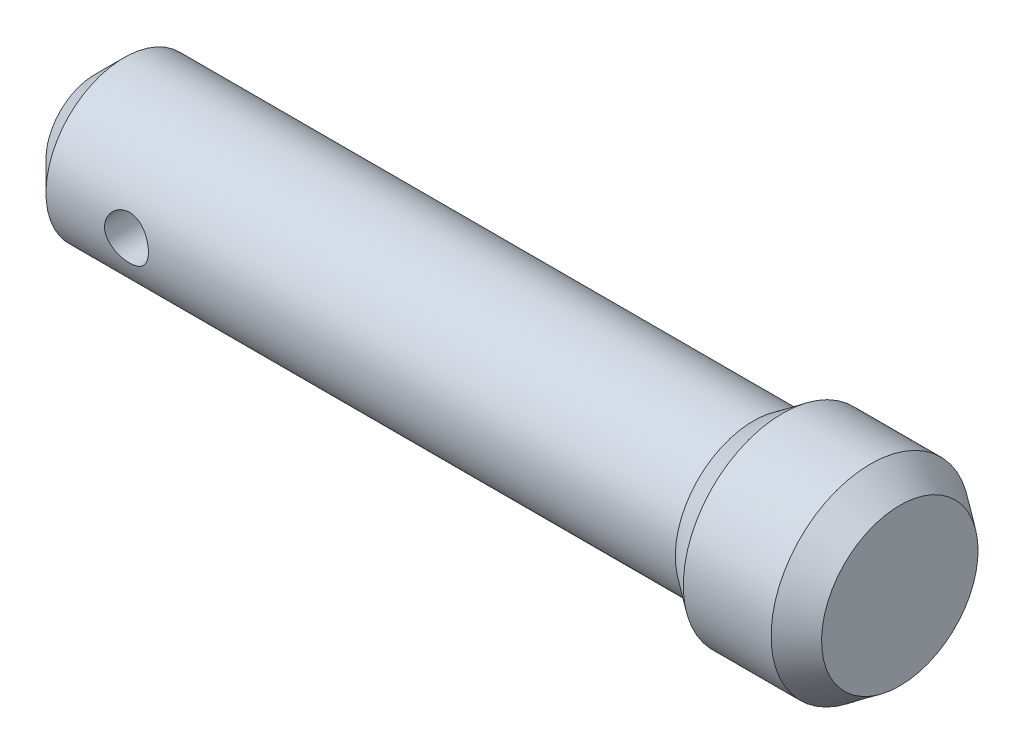
ISO-10303-21;
HEADER;
FILE_DESCRIPTION(('STEP AP214'),'2;1');
FILE_NAME('part.step','',(''),(''),'','','');
FILE_SCHEMA(('AUTOMOTIVE_DESIGN { 1 0 10303 214 1 1 1 1 }'));
ENDSEC;
DATA;
#1=APPLICATION_CONTEXT('core data for automotive mechanical design processes');
#2=APPLICATION_PROTOCOL_DEFINITION('international standard','automotive_design',2000,#1);
#3=PRODUCT_CONTEXT('',#1,'mechanical');
#4=PRODUCT('Part','Part','',(#3));
#5=PRODUCT_RELATED_PRODUCT_CATEGORY('part','',(#4));
#6=PRODUCT_DEFINITION_FORMATION('','',#4);
#7=PRODUCT_DEFINITION_CONTEXT('part definition',#1,'design');
#8=PRODUCT_DEFINITION('design','',#6,#7);
#9=PRODUCT_DEFINITION_SHAPE('','',#8);
#10=(LENGTH_UNIT() NAMED_UNIT(*) SI_UNIT(.MILLI.,.METRE.));
#11=(NAMED_UNIT(*) PLANE_ANGLE_UNIT() SI_UNIT($,.RADIAN.));
#12=(NAMED_UNIT(*) SI_UNIT($,.STERADIAN.) SOLID_ANGLE_UNIT());
#13=UNCERTAINTY_MEASURE_WITH_UNIT(LENGTH_MEASURE(1.E-05),#10,'distance_accuracy_value','');
#14=(GEOMETRIC_REPRESENTATION_CONTEXT(3) GLOBAL_UNCERTAINTY_ASSIGNED_CONTEXT((#13)) GLOBAL_UNIT_ASSIGNED_CONTEXT((#10,
#11,#12)) REPRESENTATION_CONTEXT('',''));
#15=CARTESIAN_POINT('',(0.,0.,0.));
#16=DIRECTION('',(0.,0.,1.));
#17=DIRECTION('',(1.,0.,0.));
#18=AXIS2_PLACEMENT_3D('',#15,#16,#17);
#19=CARTESIAN_POINT('',(106.,0.,0.));
#20=DIRECTION('',(1.,0.,0.));
#21=DIRECTION('',(0.,1.,0.));
#22=AXIS2_PLACEMENT_3D('',#19,#20,#21);
#23=PLANE('',#22);
#24=CARTESIAN_POINT('',(106.,-10.691540381657,0.));
#25=DIRECTION('',(-1.,0.,0.));
#26=DIRECTION('',(0.,-1.,0.));
#27=AXIS2_PLACEMENT_3D('',#24,#25,#26);
#28=CIRCLE('',#27,10.6915403816571);
#29=CARTESIAN_POINT('',(106.,-21.3830807633141,0.));
#30=VERTEX_POINT('',#29);
#31=EDGE_CURVE('E10',#30,#30,#28,.T.);
#32=ORIENTED_EDGE('',*,*,#31,.F.);
#33=EDGE_LOOP('',(#32));
#34=FACE_BOUND('',#33,.T.);
#35=ADVANCED_FACE('F33',(#34),#23,.T.);
#36=CARTESIAN_POINT('',(102.,-10.691540381657,0.));
#37=DIRECTION('',(-1.,0.,0.));
#38=DIRECTION('',(0.,-1.,0.));
#39=AXIS2_PLACEMENT_3D('',#36,#37,#38);
#40=CONICAL_SURFACE('',#39,13.5913898584774,0.627283526012526);
#41=ORIENTED_EDGE('',*,*,#31,.T.);
#42=EDGE_LOOP('',(#41));
#43=FACE_BOUND('',#42,.T.);
#44=CARTESIAN_POINT('',(102.,-10.691540381657,0.));
#45=DIRECTION('',(-1.,0.,0.));
#46=DIRECTION('',(0.,-1.,0.));
#47=AXIS2_PLACEMENT_3D('',#44,#45,#46);
#48=CIRCLE('',#47,13.5913898584774);
#49=CARTESIAN_POINT('',(102.,-24.2829302401345,0.));
#50=VERTEX_POINT('',#49);
#51=EDGE_CURVE('E44',#50,#50,#48,.T.);
#52=ORIENTED_EDGE('',*,*,#51,.F.);
#53=EDGE_LOOP('',(#52));
#54=FACE_BOUND('',#53,.T.);
#55=ADVANCED_FACE('F80',(#43,#54),#40,.T.);
#56=CARTESIAN_POINT('',(-4.,-10.6915403816571,0.));
#57=DIRECTION('',(-1.,0.,0.));
#58=DIRECTION('',(0.,-1.,0.));
#59=AXIS2_PLACEMENT_3D('',#56,#57,#58);
#60=CYLINDRICAL_SURFACE('',#59,13.5913898584774);
#61=ORIENTED_EDGE('',*,*,#51,.T.);
#62=EDGE_LOOP('',(#61));
#63=FACE_BOUND('',#62,.T.);
#64=CARTESIAN_POINT('',(90.,-10.691540381657,0.));
#65=DIRECTION('',(-1.,0.,0.));
#66=DIRECTION('',(0.,-1.,0.));
#67=AXIS2_PLACEMENT_3D('',#64,#65,#66);
#68=CIRCLE('',#67,13.5913898584775);
#69=CARTESIAN_POINT('',(90.,-24.2829302401345,0.));
#70=VERTEX_POINT('',#69);
#71=EDGE_CURVE('E49',#70,#70,#68,.T.);
#72=ORIENTED_EDGE('',*,*,#71,.F.);
#73=EDGE_LOOP('',(#72));
#74=FACE_BOUND('',#73,.T.);
#75=ADVANCED_FACE('F85',(#63,#74),#60,.T.);
#76=CARTESIAN_POINT('',(86.,-10.691540381657,0.));
#77=DIRECTION('',(1.,0.,0.));
#78=DIRECTION('',(0.,1.,0.));
#79=AXIS2_PLACEMENT_3D('',#76,#77,#78);
#80=CONICAL_SURFACE('',#79,10.6915403816571,0.627283526012528);
#81=ORIENTED_EDGE('',*,*,#71,.T.);
#82=EDGE_LOOP('',(#81));
#83=FACE_BOUND('',#82,.T.);
#84=CARTESIAN_POINT('',(86.,-10.691540381657,0.));
#85=DIRECTION('',(-1.,0.,0.));
#86=DIRECTION('',(0.,-1.,0.));
#87=AXIS2_PLACEMENT_3D('',#84,#85,#86);
#88=CIRCLE('',#87,10.6915403816571);
#89=CARTESIAN_POINT('',(86.,-21.3830807633141,0.));
#90=VERTEX_POINT('',#89);
#91=EDGE_CURVE('E101',#90,#90,#88,.T.);
#92=ORIENTED_EDGE('',*,*,#91,.F.);
#93=EDGE_LOOP('',(#92));
#94=FACE_BOUND('',#93,.T.);
#95=ADVANCED_FACE('F75',(#83,#94),#80,.T.);
#96=CARTESIAN_POINT('',(-4.,-10.6915403816571,0.));
#97=DIRECTION('',(-1.,0.,0.));
#98=DIRECTION('',(0.,-1.,0.));
#99=AXIS2_PLACEMENT_3D('',#96,#97,#98);
#100=CYLINDRICAL_SURFACE('',#99,10.6915403816571);
#101=CARTESIAN_POINT('',(14.,-10.6915403816571,-10.6915403816571));
#102=CARTESIAN_POINT('',(13.9999967961598,-10.8565962405362,-10.6915382574525));
#103=CARTESIAN_POINT('',(13.9863327937801,-11.0216853721117,-10.6876809987054));
#104=CARTESIAN_POINT('',(13.9321478029071,-11.3470867443452,-10.6726690808623));
#105=CARTESIAN_POINT('',(13.8916158959382,-11.5073970153011,-10.6615114550952));
#106=CARTESIAN_POINT('',(13.7851324767832,-11.8184981897159,-10.6331267191541));
#107=CARTESIAN_POINT('',(13.7192156790505,-11.96930176749,-10.6159079005599));
#108=CARTESIAN_POINT('',(13.5639679144063,-12.2577148460367,-10.5772082416564));
#109=CARTESIAN_POINT('',(13.4746347369703,-12.3953230994845,-10.5557269990176));
#110=CARTESIAN_POINT('',(13.2726921757482,-12.6569402870624,-10.5101993218454));
#111=CARTESIAN_POINT('',(13.1595967735565,-12.78056579909,-10.4861054225449));
#112=CARTESIAN_POINT('',(12.9143777611361,-13.0073681391066,-10.438363780994));
#113=CARTESIAN_POINT('',(12.7822514175445,-13.1105420246167,-10.4147161033861));
#114=CARTESIAN_POINT('',(12.499586577362,-13.2954412278873,-10.3700523083971));
#115=CARTESIAN_POINT('',(12.3487421841694,-13.3767146196432,-10.3490957241826));
#116=CARTESIAN_POINT('',(12.0348456326946,-13.5125907236985,-10.3128895104881));
#117=CARTESIAN_POINT('',(11.8717960042857,-13.5671989455362,-10.2976387022372));
#118=CARTESIAN_POINT('',(11.5423886920118,-13.6468422739901,-10.2750627080289));
#119=CARTESIAN_POINT('',(11.3762134179737,-13.6725774150767,-10.2675502911338));
#120=CARTESIAN_POINT('',(11.0417473234422,-13.6959280469307,-10.2607432107945));
#121=CARTESIAN_POINT('',(10.8734569519953,-13.6935494089318,-10.2614468315265));
#122=CARTESIAN_POINT('',(10.5450921558016,-13.661293349255,-10.2708254072612));
#123=CARTESIAN_POINT('',(10.3849250995589,-13.6322748143223,-10.2792513749012));
#124=CARTESIAN_POINT('',(10.0718300527321,-13.5489431792786,-10.3027249064168));
#125=CARTESIAN_POINT('',(9.91890269704007,-13.4946278652541,-10.3177730498432));
#126=CARTESIAN_POINT('',(9.62244546642802,-13.3615722296553,-10.3530060304237));
#127=CARTESIAN_POINT('',(9.4790541351236,-13.2825400168494,-10.373251706422));
#128=CARTESIAN_POINT('',(9.2072725661694,-13.1024972911168,-10.4165672839552));
#129=CARTESIAN_POINT('',(9.07888557234687,-13.0014820390794,-10.439637793999));
#130=CARTESIAN_POINT('',(8.83586386796446,-12.7759999708118,-10.4870292933569));
#131=CARTESIAN_POINT('',(8.72189717334464,-12.6508152254474,-10.5113652820193));
#132=CARTESIAN_POINT('',(8.51643020275493,-12.3828098565725,-10.5577986574468));
#133=CARTESIAN_POINT('',(8.42493101034456,-12.2399883829793,-10.5798959362135));
#134=CARTESIAN_POINT('',(8.26665798396425,-11.9396569301936,-10.6195231584671));
#135=CARTESIAN_POINT('',(8.20001603578469,-11.7820740010461,-10.6370285973998));
#136=CARTESIAN_POINT('',(8.09436882704656,-11.4573353739818,-10.6653230812652));
#137=CARTESIAN_POINT('',(8.05535685667114,-11.2901820108667,-10.6761137567709));
#138=CARTESIAN_POINT('',(8.00715136249704,-10.9567393539108,-10.6895116959626));
#139=CARTESIAN_POINT('',(7.99705082859752,-10.7905909846322,-10.6923677958542));
#140=CARTESIAN_POINT('',(8.00443497511212,-10.4589703478905,-10.6902961049337));
#141=CARTESIAN_POINT('',(8.02191647300082,-10.2934980046336,-10.6853692121544));
#142=CARTESIAN_POINT('',(8.08322836837636,-9.97123912358561,-10.6684468236614));
#143=CARTESIAN_POINT('',(8.12654311241967,-9.81434653491178,-10.656589750516));
#144=CARTESIAN_POINT('',(8.23768444400274,-9.51007715005924,-10.6271616569022));
#145=CARTESIAN_POINT('',(8.30551382147635,-9.36270143921769,-10.6095899860962));
#146=CARTESIAN_POINT('',(8.46537595733668,-9.07820019839131,-10.5701110208175));
#147=CARTESIAN_POINT('',(8.55788924584111,-8.94135658899262,-10.5481200615214));
#148=CARTESIAN_POINT('',(8.7638974394586,-8.68482116956386,-10.5023389063733));
#149=CARTESIAN_POINT('',(8.87739694591851,-8.56513313122582,-10.4785483166196));
#150=CARTESIAN_POINT('',(9.12640289415716,-8.34241295901995,-10.4309171523177));
#151=CARTESIAN_POINT('',(9.26248938527461,-8.24002335248778,-10.4070985559463));
#152=CARTESIAN_POINT('',(9.55042424486144,-8.05950742371519,-10.3629197990508));
#153=CARTESIAN_POINT('',(9.70227202799789,-7.98138020086351,-10.3425595101681));
#154=CARTESIAN_POINT('',(10.0167478449694,-7.85218430889834,-10.3078402945018));
#155=CARTESIAN_POINT('',(10.179311268329,-7.80096765537853,-10.2934486396888));
#156=CARTESIAN_POINT('',(10.5112229448638,-7.72674810107028,-10.2723200925984));
#157=CARTESIAN_POINT('',(10.6805692180179,-7.70373702772711,-10.2655809830408));
#158=CARTESIAN_POINT('',(11.0146235779804,-7.68708787004416,-10.2607195424144));
#159=CARTESIAN_POINT('',(11.179276214469,-7.69241144616748,-10.2622925919079));
#160=CARTESIAN_POINT('',(11.5052354263992,-7.72984355106396,-10.2731572234072));
#161=CARTESIAN_POINT('',(11.6665421060169,-7.76195124462921,-10.2824485647338));
#162=CARTESIAN_POINT('',(11.9797662425632,-7.85140933217612,-10.3075119161984));
#163=CARTESIAN_POINT('',(12.1317582258171,-7.90851748596321,-10.3232216407094));
#164=CARTESIAN_POINT('',(12.4241223748662,-8.04616808550506,-10.3593475562226));
#165=CARTESIAN_POINT('',(12.5644925406659,-8.12671455403041,-10.3797645550198));
#166=CARTESIAN_POINT('',(12.8345295648008,-8.31200823438615,-10.4238282761357));
#167=CARTESIAN_POINT('',(12.9637040809196,-8.41745326848815,-10.4475580349311));
#168=CARTESIAN_POINT('',(13.2028621912363,-8.6482526555091,-10.4951356173987));
#169=CARTESIAN_POINT('',(13.312840994302,-8.77361196403765,-10.5189834690233));
#170=CARTESIAN_POINT('',(13.5131454017336,-9.0443781102289,-10.5648084346626));
#171=CARTESIAN_POINT('',(13.6029246627982,-9.19020021267578,-10.5867255434967));
#172=CARTESIAN_POINT('',(13.7565568077692,-9.49548209980592,-10.6255394138944));
#173=CARTESIAN_POINT('',(13.82042454949,-9.65493400539207,-10.64243905101));
#174=CARTESIAN_POINT('',(13.9131287914993,-9.95983136873503,-10.6674114121058));
#175=CARTESIAN_POINT('',(13.9456249156052,-10.1040998147447,-10.6763903561522));
#176=CARTESIAN_POINT('',(13.9890606236663,-10.3960837000593,-10.6884554280221));
#177=CARTESIAN_POINT('',(14.0000028677606,-10.5437987117185,-10.6915422830347));
#178=CARTESIAN_POINT('',(14.,-10.6915403816571,-10.6915403816571));
#179=B_SPLINE_CURVE_WITH_KNOTS('',3,(#101,#102,#103,#104,#105,#106,#107,#108,#109,#110,#111,
#112,#113,#114,#115,#116,#117,#118,#119,#120,#121,#122,#123,#124,#125,#126,#127,#128,#129,#130,
#131,#132,#133,#134,#135,#136,#137,#138,#139,#140,#141,#142,#143,#144,#145,#146,#147,#148,#149,
#150,#151,#152,#153,#154,#155,#156,#157,#158,#159,#160,#161,#162,#163,#164,#165,#166,#167,#168,
#169,#170,#171,#172,#173,#174,#175,#176,#177,#178),.UNSPECIFIED.,.T.,.F.,(4,2,2,2,2,2,2,2,2,2,2,
2,2,2,2,2,2,2,2,2,2,2,2,2,2,2,2,2,2,2,2,2,2,2,2,2,2,2,4),(0.,0.49462541738235,0.989451962060501,
1.48360420870598,1.9778031205169,2.48331507863603,2.98889971461257,3.50423293675711,
4.01945963601982,4.52190473439214,5.0242449048411,5.51093733182905,5.99767236097842,
6.49038750643483,6.98320897699245,7.49391204454645,8.00463973738039,8.5180399160907,
9.03131537506825,9.52830182986653,10.0252309445685,10.5125581472541,10.9999408285997,
11.4976081317564,11.9953846809503,12.508822794008,13.0222418461425,13.5328071893083,
14.0432245613883,14.5350691634528,15.0268984289232,15.5140641281983,16.0013134901832,
16.5043054076449,17.0074226898316,17.5228427370104,18.0379668202315,18.4807611950073,
18.9235009175133),.UNSPECIFIED.);
#180=CARTESIAN_POINT('',(14.,-10.6915403816571,-10.6915403816571));
#181=VERTEX_POINT('',#180);
#182=EDGE_CURVE('E36',#181,#181,#179,.T.);
#183=ORIENTED_EDGE('',*,*,#182,.F.);
#184=EDGE_LOOP('',(#183));
#185=FACE_BOUND('',#184,.T.);
#186=CARTESIAN_POINT('',(14.,-10.6915403816571,10.6915403816571));
#187=CARTESIAN_POINT('',(13.9999967961598,-10.526484522778,10.6915382574525));
#188=CARTESIAN_POINT('',(13.9863327937801,-10.3613953912024,10.6876809987054));
#189=CARTESIAN_POINT('',(13.9321478029071,-10.035994018969,10.6726690808623));
#190=CARTESIAN_POINT('',(13.8916158959382,-9.87568374801306,10.6615114550952));
#191=CARTESIAN_POINT('',(13.7851324767832,-9.56458257359823,10.6331267191541));
#192=CARTESIAN_POINT('',(13.7192156790505,-9.41377899582412,10.6159079005599));
#193=CARTESIAN_POINT('',(13.5639679144063,-9.12536591727743,10.5772082416565));
#194=CARTESIAN_POINT('',(13.4746347369703,-8.98775766382966,10.5557269990176));
#195=CARTESIAN_POINT('',(13.2726921757482,-8.72614047625172,10.5101993218454));
#196=CARTESIAN_POINT('',(13.1595967735565,-8.60251496422415,10.4861054225449));
#197=CARTESIAN_POINT('',(12.9143777611361,-8.37571262420752,10.4383637809941));
#198=CARTESIAN_POINT('',(12.7822514175445,-8.27253873869743,10.4147161033861));
#199=CARTESIAN_POINT('',(12.499586577362,-8.08763953542678,10.3700523083971));
#200=CARTESIAN_POINT('',(12.3487421841694,-8.0063661436709,10.3490957241826));
#201=CARTESIAN_POINT('',(12.0348456326946,-7.87049003961558,10.3128895104881));
#202=CARTESIAN_POINT('',(11.8717960042857,-7.81588181777795,10.2976387022372));
#203=CARTESIAN_POINT('',(11.5423886920118,-7.73623848932403,10.2750627080289));
#204=CARTESIAN_POINT('',(11.3762134179737,-7.71050334823747,10.2675502911338));
#205=CARTESIAN_POINT('',(11.0417473234422,-7.68715271638344,10.2607432107945));
#206=CARTESIAN_POINT('',(10.8734569519953,-7.68953135438229,10.2614468315265));
#207=CARTESIAN_POINT('',(10.5450921558016,-7.72178741405917,10.2708254072612));
#208=CARTESIAN_POINT('',(10.3849250995589,-7.75080594899185,10.2792513749012));
#209=CARTESIAN_POINT('',(10.0718300527321,-7.83413758403553,10.3027249064168));
#210=CARTESIAN_POINT('',(9.91890269704007,-7.88845289806002,10.3177730498432));
#211=CARTESIAN_POINT('',(9.62244546642802,-8.02150853365883,10.3530060304237));
#212=CARTESIAN_POINT('',(9.4790541351236,-8.10054074646474,10.373251706422));
#213=CARTESIAN_POINT('',(9.2072725661694,-8.28058347219728,10.4165672839552));
#214=CARTESIAN_POINT('',(9.07888557234688,-8.38159872423467,10.439637793999));
#215=CARTESIAN_POINT('',(8.83586386796446,-8.6070807925023,10.4870292933569));
#216=CARTESIAN_POINT('',(8.72189717334465,-8.73226553786667,10.5113652820193));
#217=CARTESIAN_POINT('',(8.51643020275493,-9.00027090674164,10.5577986574468));
#218=CARTESIAN_POINT('',(8.42493101034457,-9.14309238033484,10.5798959362135));
#219=CARTESIAN_POINT('',(8.26665798396426,-9.44342383312054,10.6195231584672));
#220=CARTESIAN_POINT('',(8.20001603578469,-9.60100676226804,10.6370285973998));
#221=CARTESIAN_POINT('',(8.09436882704656,-9.92574538933231,10.6653230812652));
#222=CARTESIAN_POINT('',(8.05535685667114,-10.0928987524474,10.6761137567709));
#223=CARTESIAN_POINT('',(8.00715136249704,-10.4263414094033,10.6895116959626));
#224=CARTESIAN_POINT('',(7.99705082859752,-10.5924897786819,10.6923677958542));
#225=CARTESIAN_POINT('',(8.00443497511212,-10.9241104154236,10.6902961049337));
#226=CARTESIAN_POINT('',(8.02191647300082,-11.0895827586805,10.6853692121544));
#227=CARTESIAN_POINT('',(8.08322836837635,-11.4118416397285,10.6684468236614));
#228=CARTESIAN_POINT('',(8.12654311241967,-11.5687342284023,10.656589750516));
#229=CARTESIAN_POINT('',(8.23768444400274,-11.8730036132549,10.6271616569022));
#230=CARTESIAN_POINT('',(8.30551382147635,-12.0203793240964,10.6095899860962));
#231=CARTESIAN_POINT('',(8.46537595733668,-12.3048805649228,10.5701110208175));
#232=CARTESIAN_POINT('',(8.55788924584111,-12.4417241743215,10.5481200615213));
#233=CARTESIAN_POINT('',(8.7638974394586,-12.6982595937503,10.5023389063733));
#234=CARTESIAN_POINT('',(8.87739694591851,-12.8179476320883,10.4785483166196));
#235=CARTESIAN_POINT('',(9.12640289415716,-13.0406678042942,10.4309171523177));
#236=CARTESIAN_POINT('',(9.26248938527461,-13.1430574108263,10.4070985559463));
#237=CARTESIAN_POINT('',(9.55042424486144,-13.3235733395989,10.3629197990508));
#238=CARTESIAN_POINT('',(9.70227202799789,-13.4017005624506,10.3425595101681));
#239=CARTESIAN_POINT('',(10.0167478449694,-13.5308964544158,10.3078402945018));
#240=CARTESIAN_POINT('',(10.179311268329,-13.5821131079356,10.2934486396888));
#241=CARTESIAN_POINT('',(10.5112229448638,-13.6563326622438,10.2723200925983));
#242=CARTESIAN_POINT('',(10.6805692180179,-13.679343735587,10.2655809830408));
#243=CARTESIAN_POINT('',(11.0146235779804,-13.69599289327,10.2607195424144));
#244=CARTESIAN_POINT('',(11.179276214469,-13.6906693171466,10.2622925919079));
#245=CARTESIAN_POINT('',(11.5052354263992,-13.6532372122502,10.2731572234072));
#246=CARTESIAN_POINT('',(11.6665421060169,-13.6211295186849,10.2824485647338));
#247=CARTESIAN_POINT('',(11.9797662425632,-13.531671431138,10.3075119161984));
#248=CARTESIAN_POINT('',(12.1317582258171,-13.4745632773509,10.3232216407094));
#249=CARTESIAN_POINT('',(12.4241223748662,-13.3369126778091,10.3593475562226));
#250=CARTESIAN_POINT('',(12.5644925406659,-13.2563662092837,10.3797645550198));
#251=CARTESIAN_POINT('',(12.8345295648008,-13.071072528928,10.4238282761357));
#252=CARTESIAN_POINT('',(12.9637040809196,-12.965627494826,10.4475580349311));
#253=CARTESIAN_POINT('',(13.2028621912363,-12.734828107805,10.4951356173987));
#254=CARTESIAN_POINT('',(13.312840994302,-12.6094687992765,10.5189834690233));
#255=CARTESIAN_POINT('',(13.5131454017336,-12.3387026530852,10.5648084346626));
#256=CARTESIAN_POINT('',(13.6029246627982,-12.1928805506383,10.5867255434967));
#257=CARTESIAN_POINT('',(13.7565568077692,-11.8875986635082,10.6255394138944));
#258=CARTESIAN_POINT('',(13.82042454949,-11.728146757922,10.64243905101));
#259=CARTESIAN_POINT('',(13.9131287914993,-11.4232493945791,10.6674114121058));
#260=CARTESIAN_POINT('',(13.9456249156052,-11.2789809485694,10.6763903561522));
#261=CARTESIAN_POINT('',(13.9890606236663,-10.9869970632548,10.6884554280221));
#262=CARTESIAN_POINT('',(14.0000028677606,-10.8392820515956,10.6915422830347));
#263=CARTESIAN_POINT('',(14.,-10.6915403816571,10.6915403816571));
#264=B_SPLINE_CURVE_WITH_KNOTS('',3,(#186,#187,#188,#189,#190,#191,#192,#193,#194,#195,#196,
#197,#198,#199,#200,#201,#202,#203,#204,#205,#206,#207,#208,#209,#210,#211,#212,#213,#214,#215,
#216,#217,#218,#219,#220,#221,#222,#223,#224,#225,#226,#227,#228,#229,#230,#231,#232,#233,#234,
#235,#236,#237,#238,#239,#240,#241,#242,#243,#244,#245,#246,#247,#248,#249,#250,#251,#252,#253,
#254,#255,#256,#257,#258,#259,#260,#261,#262,#263),.UNSPECIFIED.,.T.,.F.,(4,2,2,2,2,2,2,2,2,2,2,
2,2,2,2,2,2,2,2,2,2,2,2,2,2,2,2,2,2,2,2,2,2,2,2,2,2,2,4),(0.,0.494625417382349,
0.989451962060499,1.48360420870598,1.9778031205169,2.48331507863602,2.98889971461257,
3.50423293675711,4.01945963601981,4.52190473439213,5.0242449048411,5.51093733182905,
5.99767236097842,6.49038750643482,6.98320897699245,7.49391204454644,8.00463973738038,
8.51803991609069,9.03131537506825,9.52830182986653,10.0252309445685,10.5125581472541,
10.9999408285997,11.4976081317564,11.9953846809503,12.508822794008,13.0222418461425,
13.5328071893083,14.0432245613883,14.5350691634528,15.0268984289232,15.5140641281983,
16.0013134901832,16.5043054076449,17.0074226898315,17.5228427370104,18.0379668202315,
18.4807611950073,18.9235009175133),.UNSPECIFIED.);
#265=CARTESIAN_POINT('',(14.,-10.6915403816571,10.6915403816571));
#266=VERTEX_POINT('',#265);
#267=EDGE_CURVE('E52',#266,#266,#264,.T.);
#268=ORIENTED_EDGE('',*,*,#267,.F.);
#269=EDGE_LOOP('',(#268));
#270=FACE_BOUND('',#269,.T.);
#271=ORIENTED_EDGE('',*,*,#91,.T.);
#272=EDGE_LOOP('',(#271));
#273=FACE_BOUND('',#272,.T.);
#274=CARTESIAN_POINT('',(0.,-10.6915403816571,0.));
#275=DIRECTION('',(-1.,0.,0.));
#276=DIRECTION('',(0.,-1.,0.));
#277=AXIS2_PLACEMENT_3D('',#274,#275,#276);
#278=CIRCLE('',#277,10.6915403816571);
#279=CARTESIAN_POINT('',(0.,-21.3830807633141,0.));
#280=VERTEX_POINT('',#279);
#281=EDGE_CURVE('E103',#280,#280,#278,.T.);
#282=ORIENTED_EDGE('',*,*,#281,.F.);
#283=EDGE_LOOP('',(#282));
#284=FACE_BOUND('',#283,.T.);
#285=ADVANCED_FACE('F56',(#185,#270,#273,#284),#100,.T.);
#286=CARTESIAN_POINT('',(0.,-10.6915403816571,0.));
#287=DIRECTION('',(1.,0.,0.));
#288=DIRECTION('',(0.,1.,0.));
#289=AXIS2_PLACEMENT_3D('',#286,#287,#288);
#290=CONICAL_SURFACE('',#289,10.6915403816571,0.785398163397443);
#291=CARTESIAN_POINT('',(-4.00000000000003,-10.6915403816571,0.));
#292=DIRECTION('',(-1.,0.,0.));
#293=DIRECTION('',(0.,-1.,0.));
#294=AXIS2_PLACEMENT_3D('',#291,#292,#293);
#295=CIRCLE('',#294,6.69154038165706);
#296=CARTESIAN_POINT('',(-4.00000000000003,-17.3830807633141,0.));
#297=VERTEX_POINT('',#296);
#298=EDGE_CURVE('E106',#297,#297,#295,.T.);
#299=ORIENTED_EDGE('',*,*,#298,.F.);
#300=EDGE_LOOP('',(#299));
#301=FACE_BOUND('',#300,.T.);
#302=ORIENTED_EDGE('',*,*,#281,.T.);
#303=EDGE_LOOP('',(#302));
#304=FACE_BOUND('',#303,.T.);
#305=ADVANCED_FACE('F68',(#301,#304),#290,.T.);
#306=CARTESIAN_POINT('',(-4.00000000000002,0.,0.));
#307=DIRECTION('',(1.,0.,0.));
#308=DIRECTION('',(0.,1.,0.));
#309=AXIS2_PLACEMENT_3D('',#306,#307,#308);
#310=PLANE('',#309);
#311=ORIENTED_EDGE('',*,*,#298,.T.);
#312=EDGE_LOOP('',(#311));
#313=FACE_BOUND('',#312,.T.);
#314=ADVANCED_FACE('F64',(#313),#310,.F.);
#315=CARTESIAN_POINT('',(11.,-10.6915403816571,-13.5913898584775));
#316=DIRECTION('',(0.,0.,1.));
#317=DIRECTION('',(1.,0.,0.));
#318=AXIS2_PLACEMENT_3D('',#315,#316,#317);
#319=CYLINDRICAL_SURFACE('',#318,3.);
#320=ORIENTED_EDGE('',*,*,#182,.T.);
#321=EDGE_LOOP('',(#320));
#322=FACE_BOUND('',#321,.T.);
#323=ORIENTED_EDGE('',*,*,#267,.T.);
#324=EDGE_LOOP('',(#323));
#325=FACE_BOUND('',#324,.T.);
#326=ADVANCED_FACE('F60',(#322,#325),#319,.F.);
#327=CLOSED_SHELL('',(#35,#55,#75,#95,#285,#305,#314,#326));
#328=MANIFOLD_SOLID_BREP('B2',#327);
#329=ADVANCED_BREP_SHAPE_REPRESENTATION('',(#18,#328),#14);
#330=SHAPE_DEFINITION_REPRESENTATION(#9,#329);
ENDSEC;
END-ISO-10303-21;
